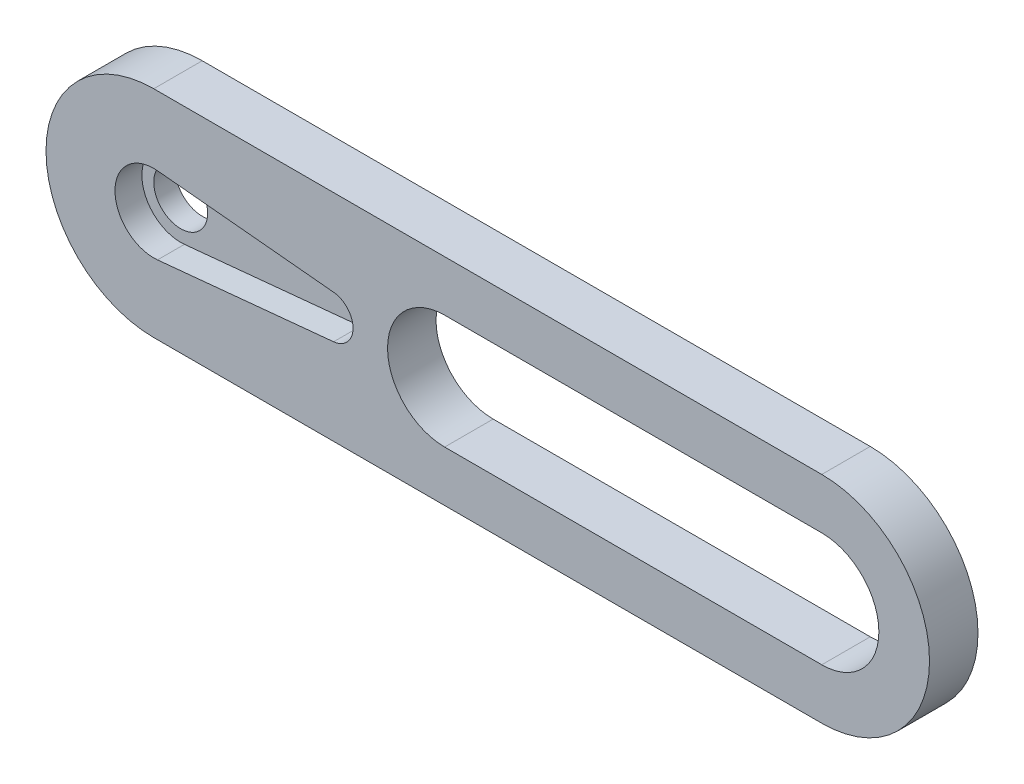
ISO-10303-21;
HEADER;
FILE_DESCRIPTION(('STEP AP214'),'2;1');
FILE_NAME('part.step','',(''),(''),'','','');
FILE_SCHEMA(('AUTOMOTIVE_DESIGN { 1 0 10303 214 1 1 1 1 }'));
ENDSEC;
DATA;
#1=APPLICATION_CONTEXT('core data for automotive mechanical design processes');
#2=APPLICATION_PROTOCOL_DEFINITION('international standard','automotive_design',2000,#1);
#3=PRODUCT_CONTEXT('',#1,'mechanical');
#4=PRODUCT('Part','Part','',(#3));
#5=PRODUCT_RELATED_PRODUCT_CATEGORY('part','',(#4));
#6=PRODUCT_DEFINITION_FORMATION('','',#4);
#7=PRODUCT_DEFINITION_CONTEXT('part definition',#1,'design');
#8=PRODUCT_DEFINITION('design','',#6,#7);
#9=PRODUCT_DEFINITION_SHAPE('','',#8);
#10=(LENGTH_UNIT() NAMED_UNIT(*) SI_UNIT(.MILLI.,.METRE.));
#11=(NAMED_UNIT(*) PLANE_ANGLE_UNIT() SI_UNIT($,.RADIAN.));
#12=(NAMED_UNIT(*) SI_UNIT($,.STERADIAN.) SOLID_ANGLE_UNIT());
#13=UNCERTAINTY_MEASURE_WITH_UNIT(LENGTH_MEASURE(1.E-05),#10,'distance_accuracy_value','');
#14=(GEOMETRIC_REPRESENTATION_CONTEXT(3) GLOBAL_UNCERTAINTY_ASSIGNED_CONTEXT((#13)) GLOBAL_UNIT_ASSIGNED_CONTEXT((#10,
#11,#12)) REPRESENTATION_CONTEXT('',''));
#15=CARTESIAN_POINT('',(0.,0.,0.));
#16=DIRECTION('',(0.,0.,1.));
#17=DIRECTION('',(1.,0.,0.));
#18=AXIS2_PLACEMENT_3D('',#15,#16,#17);
#19=CARTESIAN_POINT('',(0.,0.,2.5));
#20=DIRECTION('',(0.,0.,-1.));
#21=DIRECTION('',(-1.,0.,0.));
#22=AXIS2_PLACEMENT_3D('',#19,#20,#21);
#23=PLANE('',#22);
#24=CARTESIAN_POINT('',(0.,0.,2.5));
#25=DIRECTION('',(0.,0.,1.));
#26=DIRECTION('',(1.,0.,0.));
#27=AXIS2_PLACEMENT_3D('',#24,#25,#26);
#28=CIRCLE('',#27,3.6);
#29=CARTESIAN_POINT('',(0.349090909090909,3.58303440357333,2.5));
#30=VERTEX_POINT('',#29);
#31=CARTESIAN_POINT('',(0.349090909090909,-3.58303440357333,2.5));
#32=VERTEX_POINT('',#31);
#33=EDGE_CURVE('E176',#30,#32,#28,.T.);
#34=ORIENTED_EDGE('',*,*,#33,.F.);
#35=DIRECTION('',(-0.995287334325925,0.096969696969697,0.));
#36=VECTOR('',#35,1.);
#37=CARTESIAN_POINT('',(0.349090909090909,3.58303440357333,2.5));
#38=LINE('',#37,#36);
#39=CARTESIAN_POINT('',(16.6939393939394,1.99057466865185,2.5));
#40=VERTEX_POINT('',#39);
#41=EDGE_CURVE('E184',#40,#30,#38,.T.);
#42=ORIENTED_EDGE('',*,*,#41,.F.);
#43=CARTESIAN_POINT('',(16.5,0.,2.5));
#44=DIRECTION('',(0.,0.,1.));
#45=DIRECTION('',(1.,0.,0.));
#46=AXIS2_PLACEMENT_3D('',#43,#44,#45);
#47=CIRCLE('',#46,2.);
#48=CARTESIAN_POINT('',(16.6939393939394,-1.99057466865185,2.5));
#49=VERTEX_POINT('',#48);
#50=EDGE_CURVE('E181',#49,#40,#47,.T.);
#51=ORIENTED_EDGE('',*,*,#50,.F.);
#52=DIRECTION('',(0.995287334325925,0.0969696969696969,0.));
#53=VECTOR('',#52,1.);
#54=CARTESIAN_POINT('',(16.6939393939394,-1.99057466865185,2.5));
#55=LINE('',#54,#53);
#56=EDGE_CURVE('E178',#32,#49,#55,.T.);
#57=ORIENTED_EDGE('',*,*,#56,.F.);
#58=EDGE_LOOP('',(#34,#42,#51,#57));
#59=FACE_BOUND('',#58,.T.);
#60=CARTESIAN_POINT('',(0.,0.,2.5));
#61=DIRECTION('',(0.,0.,1.));
#62=DIRECTION('',(-1.,0.,0.));
#63=AXIS2_PLACEMENT_3D('',#60,#61,#62);
#64=CIRCLE('',#63,10.);
#65=CARTESIAN_POINT('',(0.,10.,2.5));
#66=VERTEX_POINT('',#65);
#67=CARTESIAN_POINT('',(0.,-10.,2.5));
#68=VERTEX_POINT('',#67);
#69=EDGE_CURVE('E205',#66,#68,#64,.T.);
#70=ORIENTED_EDGE('',*,*,#69,.T.);
#71=DIRECTION('',(1.,0.,0.));
#72=VECTOR('',#71,1.);
#73=CARTESIAN_POINT('',(0.,-10.,2.5));
#74=LINE('',#73,#72);
#75=CARTESIAN_POINT('',(62.,-10.,2.5));
#76=VERTEX_POINT('',#75);
#77=EDGE_CURVE('E208',#68,#76,#74,.T.);
#78=ORIENTED_EDGE('',*,*,#77,.T.);
#79=CARTESIAN_POINT('',(62.,0.,2.5));
#80=DIRECTION('',(0.,0.,1.));
#81=DIRECTION('',(-1.,0.,0.));
#82=AXIS2_PLACEMENT_3D('',#79,#80,#81);
#83=CIRCLE('',#82,10.);
#84=CARTESIAN_POINT('',(62.,10.,2.5));
#85=VERTEX_POINT('',#84);
#86=EDGE_CURVE('E210',#76,#85,#83,.T.);
#87=ORIENTED_EDGE('',*,*,#86,.T.);
#88=DIRECTION('',(-1.,0.,0.));
#89=VECTOR('',#88,1.);
#90=CARTESIAN_POINT('',(0.,10.,2.5));
#91=LINE('',#90,#89);
#92=EDGE_CURVE('E212',#85,#66,#91,.T.);
#93=ORIENTED_EDGE('',*,*,#92,.T.);
#94=EDGE_LOOP('',(#70,#78,#87,#93));
#95=FACE_BOUND('',#94,.T.);
#96=CARTESIAN_POINT('',(27.,0.,2.5));
#97=DIRECTION('',(0.,0.,1.));
#98=DIRECTION('',(1.,0.,0.));
#99=AXIS2_PLACEMENT_3D('',#96,#97,#98);
#100=CIRCLE('',#99,5.3);
#101=CARTESIAN_POINT('',(27.,5.3,2.5));
#102=VERTEX_POINT('',#101);
#103=CARTESIAN_POINT('',(27.,-5.3,2.5));
#104=VERTEX_POINT('',#103);
#105=EDGE_CURVE('E129',#102,#104,#100,.T.);
#106=ORIENTED_EDGE('',*,*,#105,.F.);
#107=DIRECTION('',(-1.,0.,0.));
#108=VECTOR('',#107,1.);
#109=CARTESIAN_POINT('',(27.,5.3,2.5));
#110=LINE('',#109,#108);
#111=CARTESIAN_POINT('',(62.,5.3,2.5));
#112=VERTEX_POINT('',#111);
#113=EDGE_CURVE('E170',#112,#102,#110,.T.);
#114=ORIENTED_EDGE('',*,*,#113,.F.);
#115=CARTESIAN_POINT('',(62.,0.,2.5));
#116=DIRECTION('',(0.,0.,1.));
#117=DIRECTION('',(1.,0.,0.));
#118=AXIS2_PLACEMENT_3D('',#115,#116,#117);
#119=CIRCLE('',#118,5.3);
#120=CARTESIAN_POINT('',(62.,-5.3,2.5));
#121=VERTEX_POINT('',#120);
#122=EDGE_CURVE('E168',#121,#112,#119,.T.);
#123=ORIENTED_EDGE('',*,*,#122,.F.);
#124=DIRECTION('',(1.,0.,0.));
#125=VECTOR('',#124,1.);
#126=CARTESIAN_POINT('',(27.,-5.3,2.5));
#127=LINE('',#126,#125);
#128=EDGE_CURVE('E166',#104,#121,#127,.T.);
#129=ORIENTED_EDGE('',*,*,#128,.F.);
#130=EDGE_LOOP('',(#106,#114,#123,#129));
#131=FACE_BOUND('',#130,.T.);
#132=ADVANCED_FACE('F33',(#59,#95,#131),#23,.F.);
#133=CARTESIAN_POINT('',(0.,0.,2.5));
#134=DIRECTION('',(0.,0.,-1.));
#135=DIRECTION('',(-1.,0.,0.));
#136=AXIS2_PLACEMENT_3D('',#133,#134,#135);
#137=CYLINDRICAL_SURFACE('',#136,10.);
#138=DIRECTION('',(0.,0.,-1.));
#139=VECTOR('',#138,1.);
#140=CARTESIAN_POINT('',(0.,10.,2.5));
#141=LINE('',#140,#139);
#142=CARTESIAN_POINT('',(0.,10.,-2.));
#143=VERTEX_POINT('',#142);
#144=EDGE_CURVE('E214',#66,#143,#141,.T.);
#145=ORIENTED_EDGE('',*,*,#144,.T.);
#146=CARTESIAN_POINT('',(0.,0.,-2.));
#147=DIRECTION('',(0.,0.,-1.));
#148=DIRECTION('',(-1.,0.,0.));
#149=AXIS2_PLACEMENT_3D('',#146,#147,#148);
#150=CIRCLE('',#149,10.);
#151=CARTESIAN_POINT('',(0.,-10.,-2.));
#152=VERTEX_POINT('',#151);
#153=EDGE_CURVE('E151',#152,#143,#150,.T.);
#154=ORIENTED_EDGE('',*,*,#153,.F.);
#155=DIRECTION('',(0.,0.,-1.));
#156=VECTOR('',#155,1.);
#157=CARTESIAN_POINT('',(0.,-10.,2.5));
#158=LINE('',#157,#156);
#159=EDGE_CURVE('E11',#68,#152,#158,.T.);
#160=ORIENTED_EDGE('',*,*,#159,.F.);
#161=ORIENTED_EDGE('',*,*,#69,.F.);
#162=EDGE_LOOP('',(#145,#154,#160,#161));
#163=FACE_BOUND('',#162,.T.);
#164=ADVANCED_FACE('F35',(#163),#137,.T.);
#165=CARTESIAN_POINT('',(0.,-10.,2.5));
#166=DIRECTION('',(0.,1.,0.));
#167=DIRECTION('',(-1.,0.,0.));
#168=AXIS2_PLACEMENT_3D('',#165,#166,#167);
#169=PLANE('',#168);
#170=ORIENTED_EDGE('',*,*,#159,.T.);
#171=DIRECTION('',(-1.,0.,0.));
#172=VECTOR('',#171,1.);
#173=CARTESIAN_POINT('',(0.,-10.,-2.));
#174=LINE('',#173,#172);
#175=CARTESIAN_POINT('',(62.,-10.,-2.));
#176=VERTEX_POINT('',#175);
#177=EDGE_CURVE('E162',#176,#152,#174,.T.);
#178=ORIENTED_EDGE('',*,*,#177,.F.);
#179=DIRECTION('',(0.,0.,-1.));
#180=VECTOR('',#179,1.);
#181=CARTESIAN_POINT('',(62.,-10.,2.5));
#182=LINE('',#181,#180);
#183=EDGE_CURVE('E41',#76,#176,#182,.T.);
#184=ORIENTED_EDGE('',*,*,#183,.F.);
#185=ORIENTED_EDGE('',*,*,#77,.F.);
#186=EDGE_LOOP('',(#170,#178,#184,#185));
#187=FACE_BOUND('',#186,.T.);
#188=ADVANCED_FACE('F228',(#187),#169,.F.);
#189=CARTESIAN_POINT('',(62.,0.,2.5));
#190=DIRECTION('',(0.,0.,-1.));
#191=DIRECTION('',(-1.,0.,0.));
#192=AXIS2_PLACEMENT_3D('',#189,#190,#191);
#193=CYLINDRICAL_SURFACE('',#192,10.);
#194=ORIENTED_EDGE('',*,*,#183,.T.);
#195=CARTESIAN_POINT('',(62.,0.,-2.));
#196=DIRECTION('',(0.,0.,-1.));
#197=DIRECTION('',(-1.,0.,0.));
#198=AXIS2_PLACEMENT_3D('',#195,#196,#197);
#199=CIRCLE('',#198,10.);
#200=CARTESIAN_POINT('',(62.,10.,-2.));
#201=VERTEX_POINT('',#200);
#202=EDGE_CURVE('E159',#201,#176,#199,.T.);
#203=ORIENTED_EDGE('',*,*,#202,.F.);
#204=DIRECTION('',(0.,0.,-1.));
#205=VECTOR('',#204,1.);
#206=CARTESIAN_POINT('',(62.,10.,2.5));
#207=LINE('',#206,#205);
#208=EDGE_CURVE('E216',#85,#201,#207,.T.);
#209=ORIENTED_EDGE('',*,*,#208,.F.);
#210=ORIENTED_EDGE('',*,*,#86,.F.);
#211=EDGE_LOOP('',(#194,#203,#209,#210));
#212=FACE_BOUND('',#211,.T.);
#213=ADVANCED_FACE('F221',(#212),#193,.T.);
#214=CARTESIAN_POINT('',(0.,10.,2.5));
#215=DIRECTION('',(0.,-1.,0.));
#216=DIRECTION('',(1.,0.,0.));
#217=AXIS2_PLACEMENT_3D('',#214,#215,#216);
#218=PLANE('',#217);
#219=ORIENTED_EDGE('',*,*,#208,.T.);
#220=DIRECTION('',(1.,0.,0.));
#221=VECTOR('',#220,1.);
#222=CARTESIAN_POINT('',(0.,10.,-2.));
#223=LINE('',#222,#221);
#224=EDGE_CURVE('E156',#143,#201,#223,.T.);
#225=ORIENTED_EDGE('',*,*,#224,.F.);
#226=ORIENTED_EDGE('',*,*,#144,.F.);
#227=ORIENTED_EDGE('',*,*,#92,.F.);
#228=EDGE_LOOP('',(#219,#225,#226,#227));
#229=FACE_BOUND('',#228,.T.);
#230=ADVANCED_FACE('F235',(#229),#218,.F.);
#231=CARTESIAN_POINT('',(0.,0.,2.5));
#232=DIRECTION('',(0.,0.,-1.));
#233=DIRECTION('',(-1.,0.,0.));
#234=AXIS2_PLACEMENT_3D('',#231,#232,#233);
#235=CYLINDRICAL_SURFACE('',#234,3.6);
#236=CARTESIAN_POINT('',(0.,0.,0.));
#237=DIRECTION('',(0.,0.,1.));
#238=DIRECTION('',(1.,0.,0.));
#239=AXIS2_PLACEMENT_3D('',#236,#237,#238);
#240=CIRCLE('',#239,3.6);
#241=CARTESIAN_POINT('',(0.349090909090909,3.58303440357333,0.));
#242=VERTEX_POINT('',#241);
#243=CARTESIAN_POINT('',(0.349090909090909,-3.58303440357333,0.));
#244=VERTEX_POINT('',#243);
#245=EDGE_CURVE('E131',#242,#244,#240,.T.);
#246=ORIENTED_EDGE('',*,*,#245,.F.);
#247=DIRECTION('',(0.,0.,-1.));
#248=VECTOR('',#247,1.);
#249=CARTESIAN_POINT('',(0.349090909090909,3.58303440357333,2.5));
#250=LINE('',#249,#248);
#251=EDGE_CURVE('E186',#30,#242,#250,.T.);
#252=ORIENTED_EDGE('',*,*,#251,.F.);
#253=ORIENTED_EDGE('',*,*,#33,.T.);
#254=DIRECTION('',(0.,0.,-1.));
#255=VECTOR('',#254,1.);
#256=CARTESIAN_POINT('',(0.349090909090909,-3.58303440357333,2.5));
#257=LINE('',#256,#255);
#258=EDGE_CURVE('E202',#32,#244,#257,.T.);
#259=ORIENTED_EDGE('',*,*,#258,.T.);
#260=EDGE_LOOP('',(#246,#252,#253,#259));
#261=FACE_BOUND('',#260,.T.);
#262=ADVANCED_FACE('F273',(#261),#235,.F.);
#263=CARTESIAN_POINT('',(16.6939393939394,-1.99057466865185,2.5));
#264=DIRECTION('',(-0.0969696969696969,0.995287334325925,0.));
#265=DIRECTION('',(-0.995287334325925,-0.0969696969696969,0.));
#266=AXIS2_PLACEMENT_3D('',#263,#264,#265);
#267=PLANE('',#266);
#268=DIRECTION('',(0.995287334325925,0.0969696969696969,0.));
#269=VECTOR('',#268,1.);
#270=CARTESIAN_POINT('',(16.6939393939394,-1.99057466865185,0.));
#271=LINE('',#270,#269);
#272=CARTESIAN_POINT('',(16.6939393939394,-1.99057466865185,0.));
#273=VERTEX_POINT('',#272);
#274=EDGE_CURVE('E189',#244,#273,#271,.T.);
#275=ORIENTED_EDGE('',*,*,#274,.F.);
#276=ORIENTED_EDGE('',*,*,#258,.F.);
#277=ORIENTED_EDGE('',*,*,#56,.T.);
#278=DIRECTION('',(0.,0.,-1.));
#279=VECTOR('',#278,1.);
#280=CARTESIAN_POINT('',(16.6939393939394,-1.99057466865185,2.5));
#281=LINE('',#280,#279);
#282=EDGE_CURVE('E200',#49,#273,#281,.T.);
#283=ORIENTED_EDGE('',*,*,#282,.T.);
#284=EDGE_LOOP('',(#275,#276,#277,#283));
#285=FACE_BOUND('',#284,.T.);
#286=ADVANCED_FACE('F269',(#285),#267,.T.);
#287=CARTESIAN_POINT('',(16.5,0.,2.5));
#288=DIRECTION('',(0.,0.,-1.));
#289=DIRECTION('',(-1.,0.,0.));
#290=AXIS2_PLACEMENT_3D('',#287,#288,#289);
#291=CYLINDRICAL_SURFACE('',#290,2.);
#292=CARTESIAN_POINT('',(16.5,0.,0.));
#293=DIRECTION('',(0.,0.,1.));
#294=DIRECTION('',(1.,0.,0.));
#295=AXIS2_PLACEMENT_3D('',#292,#293,#294);
#296=CIRCLE('',#295,2.);
#297=CARTESIAN_POINT('',(16.6939393939394,1.99057466865185,0.));
#298=VERTEX_POINT('',#297);
#299=EDGE_CURVE('E192',#273,#298,#296,.T.);
#300=ORIENTED_EDGE('',*,*,#299,.F.);
#301=ORIENTED_EDGE('',*,*,#282,.F.);
#302=ORIENTED_EDGE('',*,*,#50,.T.);
#303=DIRECTION('',(0.,0.,-1.));
#304=VECTOR('',#303,1.);
#305=CARTESIAN_POINT('',(16.6939393939394,1.99057466865185,2.5));
#306=LINE('',#305,#304);
#307=EDGE_CURVE('E198',#40,#298,#306,.T.);
#308=ORIENTED_EDGE('',*,*,#307,.T.);
#309=EDGE_LOOP('',(#300,#301,#302,#308));
#310=FACE_BOUND('',#309,.T.);
#311=ADVANCED_FACE('F265',(#310),#291,.F.);
#312=CARTESIAN_POINT('',(0.349090909090909,3.58303440357333,2.5));
#313=DIRECTION('',(-0.096969696969697,-0.995287334325925,0.));
#314=DIRECTION('',(0.995287334325925,-0.096969696969697,0.));
#315=AXIS2_PLACEMENT_3D('',#312,#313,#314);
#316=PLANE('',#315);
#317=DIRECTION('',(-0.995287334325925,0.096969696969697,0.));
#318=VECTOR('',#317,1.);
#319=CARTESIAN_POINT('',(0.349090909090909,3.58303440357333,0.));
#320=LINE('',#319,#318);
#321=EDGE_CURVE('E179',#298,#242,#320,.T.);
#322=ORIENTED_EDGE('',*,*,#321,.F.);
#323=ORIENTED_EDGE('',*,*,#307,.F.);
#324=ORIENTED_EDGE('',*,*,#41,.T.);
#325=ORIENTED_EDGE('',*,*,#251,.T.);
#326=EDGE_LOOP('',(#322,#323,#324,#325));
#327=FACE_BOUND('',#326,.T.);
#328=ADVANCED_FACE('F262',(#327),#316,.T.);
#329=CARTESIAN_POINT('',(27.,0.,2.5));
#330=DIRECTION('',(0.,0.,-1.));
#331=DIRECTION('',(-1.,0.,0.));
#332=AXIS2_PLACEMENT_3D('',#329,#330,#331);
#333=CYLINDRICAL_SURFACE('',#332,5.3);
#334=DIRECTION('',(0.,0.,-1.));
#335=VECTOR('',#334,1.);
#336=CARTESIAN_POINT('',(27.,-5.3,2.5));
#337=LINE('',#336,#335);
#338=CARTESIAN_POINT('',(27.,-5.3,-2.));
#339=VERTEX_POINT('',#338);
#340=EDGE_CURVE('E122',#104,#339,#337,.T.);
#341=ORIENTED_EDGE('',*,*,#340,.T.);
#342=CARTESIAN_POINT('',(27.,0.,-2.));
#343=DIRECTION('',(0.,0.,1.));
#344=DIRECTION('',(1.,0.,0.));
#345=AXIS2_PLACEMENT_3D('',#342,#343,#344);
#346=CIRCLE('',#345,5.3);
#347=CARTESIAN_POINT('',(27.,5.3,-2.));
#348=VERTEX_POINT('',#347);
#349=EDGE_CURVE('E126',#348,#339,#346,.T.);
#350=ORIENTED_EDGE('',*,*,#349,.F.);
#351=DIRECTION('',(0.,0.,-1.));
#352=VECTOR('',#351,1.);
#353=CARTESIAN_POINT('',(27.,5.3,2.5));
#354=LINE('',#353,#352);
#355=EDGE_CURVE('E172',#102,#348,#354,.T.);
#356=ORIENTED_EDGE('',*,*,#355,.F.);
#357=ORIENTED_EDGE('',*,*,#105,.T.);
#358=EDGE_LOOP('',(#341,#350,#356,#357));
#359=FACE_BOUND('',#358,.T.);
#360=ADVANCED_FACE('F123',(#359),#333,.F.);
#361=CARTESIAN_POINT('',(27.,-5.3,2.5));
#362=DIRECTION('',(0.,1.,0.));
#363=DIRECTION('',(0.,0.,1.));
#364=AXIS2_PLACEMENT_3D('',#361,#362,#363);
#365=PLANE('',#364);
#366=DIRECTION('',(0.,0.,-1.));
#367=VECTOR('',#366,1.);
#368=CARTESIAN_POINT('',(62.,-5.3,2.5));
#369=LINE('',#368,#367);
#370=CARTESIAN_POINT('',(62.,-5.3,-2.));
#371=VERTEX_POINT('',#370);
#372=EDGE_CURVE('E48',#121,#371,#369,.T.);
#373=ORIENTED_EDGE('',*,*,#372,.T.);
#374=DIRECTION('',(1.,0.,0.));
#375=VECTOR('',#374,1.);
#376=CARTESIAN_POINT('',(27.,-5.3,-2.));
#377=LINE('',#376,#375);
#378=EDGE_CURVE('E134',#339,#371,#377,.T.);
#379=ORIENTED_EDGE('',*,*,#378,.F.);
#380=ORIENTED_EDGE('',*,*,#340,.F.);
#381=ORIENTED_EDGE('',*,*,#128,.T.);
#382=EDGE_LOOP('',(#373,#379,#380,#381));
#383=FACE_BOUND('',#382,.T.);
#384=ADVANCED_FACE('F135',(#383),#365,.T.);
#385=CARTESIAN_POINT('',(62.,0.,2.5));
#386=DIRECTION('',(0.,0.,-1.));
#387=DIRECTION('',(-1.,0.,0.));
#388=AXIS2_PLACEMENT_3D('',#385,#386,#387);
#389=CYLINDRICAL_SURFACE('',#388,5.3);
#390=DIRECTION('',(0.,0.,-1.));
#391=VECTOR('',#390,1.);
#392=CARTESIAN_POINT('',(62.,5.3,2.5));
#393=LINE('',#392,#391);
#394=CARTESIAN_POINT('',(62.,5.3,-2.));
#395=VERTEX_POINT('',#394);
#396=EDGE_CURVE('E56',#112,#395,#393,.T.);
#397=ORIENTED_EDGE('',*,*,#396,.T.);
#398=CARTESIAN_POINT('',(62.,0.,-2.));
#399=DIRECTION('',(0.,0.,1.));
#400=DIRECTION('',(1.,0.,0.));
#401=AXIS2_PLACEMENT_3D('',#398,#399,#400);
#402=CIRCLE('',#401,5.3);
#403=EDGE_CURVE('E138',#371,#395,#402,.T.);
#404=ORIENTED_EDGE('',*,*,#403,.F.);
#405=ORIENTED_EDGE('',*,*,#372,.F.);
#406=ORIENTED_EDGE('',*,*,#122,.T.);
#407=EDGE_LOOP('',(#397,#404,#405,#406));
#408=FACE_BOUND('',#407,.T.);
#409=ADVANCED_FACE('F244',(#408),#389,.F.);
#410=CARTESIAN_POINT('',(27.,5.3,2.5));
#411=DIRECTION('',(0.,-1.,0.));
#412=DIRECTION('',(0.,0.,-1.));
#413=AXIS2_PLACEMENT_3D('',#410,#411,#412);
#414=PLANE('',#413);
#415=ORIENTED_EDGE('',*,*,#355,.T.);
#416=DIRECTION('',(-1.,0.,0.));
#417=VECTOR('',#416,1.);
#418=CARTESIAN_POINT('',(27.,5.3,-2.));
#419=LINE('',#418,#417);
#420=EDGE_CURVE('E142',#395,#348,#419,.T.);
#421=ORIENTED_EDGE('',*,*,#420,.F.);
#422=ORIENTED_EDGE('',*,*,#396,.F.);
#423=ORIENTED_EDGE('',*,*,#113,.T.);
#424=EDGE_LOOP('',(#415,#421,#422,#423));
#425=FACE_BOUND('',#424,.T.);
#426=ADVANCED_FACE('F245',(#425),#414,.T.);
#427=CARTESIAN_POINT('',(0.,0.,0.));
#428=DIRECTION('',(0.,0.,-1.));
#429=DIRECTION('',(-1.,0.,0.));
#430=AXIS2_PLACEMENT_3D('',#427,#428,#429);
#431=PLANE('',#430);
#432=ORIENTED_EDGE('',*,*,#245,.T.);
#433=ORIENTED_EDGE('',*,*,#274,.T.);
#434=ORIENTED_EDGE('',*,*,#299,.T.);
#435=ORIENTED_EDGE('',*,*,#321,.T.);
#436=EDGE_LOOP('',(#432,#433,#434,#435));
#437=FACE_BOUND('',#436,.T.);
#438=CARTESIAN_POINT('',(0.,0.,0.));
#439=DIRECTION('',(0.,0.,-1.));
#440=DIRECTION('',(-1.,0.,0.));
#441=AXIS2_PLACEMENT_3D('',#438,#439,#440);
#442=CIRCLE('',#441,2.5);
#443=CARTESIAN_POINT('',(-2.5,0.,0.));
#444=VERTEX_POINT('',#443);
#445=EDGE_CURVE('E147',#444,#444,#442,.T.);
#446=ORIENTED_EDGE('',*,*,#445,.T.);
#447=EDGE_LOOP('',(#446));
#448=FACE_BOUND('',#447,.T.);
#449=ADVANCED_FACE('F247',(#437,#448),#431,.F.);
#450=CARTESIAN_POINT('',(0.,0.,-2.));
#451=DIRECTION('',(0.,0.,-1.));
#452=DIRECTION('',(-1.,0.,0.));
#453=AXIS2_PLACEMENT_3D('',#450,#451,#452);
#454=PLANE('',#453);
#455=ORIENTED_EDGE('',*,*,#349,.T.);
#456=ORIENTED_EDGE('',*,*,#378,.T.);
#457=ORIENTED_EDGE('',*,*,#403,.T.);
#458=ORIENTED_EDGE('',*,*,#420,.T.);
#459=EDGE_LOOP('',(#455,#456,#457,#458));
#460=FACE_BOUND('',#459,.T.);
#461=ORIENTED_EDGE('',*,*,#153,.T.);
#462=ORIENTED_EDGE('',*,*,#224,.T.);
#463=ORIENTED_EDGE('',*,*,#202,.T.);
#464=ORIENTED_EDGE('',*,*,#177,.T.);
#465=EDGE_LOOP('',(#461,#462,#463,#464));
#466=FACE_BOUND('',#465,.T.);
#467=CARTESIAN_POINT('',(0.,0.,-2.));
#468=DIRECTION('',(0.,0.,-1.));
#469=DIRECTION('',(-1.,0.,0.));
#470=AXIS2_PLACEMENT_3D('',#467,#468,#469);
#471=CIRCLE('',#470,2.5);
#472=CARTESIAN_POINT('',(-2.5,0.,-2.));
#473=VERTEX_POINT('',#472);
#474=EDGE_CURVE('E148',#473,#473,#471,.T.);
#475=ORIENTED_EDGE('',*,*,#474,.F.);
#476=EDGE_LOOP('',(#475));
#477=FACE_BOUND('',#476,.T.);
#478=ADVANCED_FACE('F140',(#460,#466,#477),#454,.T.);
#479=CARTESIAN_POINT('',(0.,0.,-2.));
#480=DIRECTION('',(0.,0.,1.));
#481=DIRECTION('',(1.,0.,0.));
#482=AXIS2_PLACEMENT_3D('',#479,#480,#481);
#483=CYLINDRICAL_SURFACE('',#482,2.5);
#484=ORIENTED_EDGE('',*,*,#474,.T.);
#485=EDGE_LOOP('',(#484));
#486=FACE_BOUND('',#485,.T.);
#487=ORIENTED_EDGE('',*,*,#445,.F.);
#488=EDGE_LOOP('',(#487));
#489=FACE_BOUND('',#488,.T.);
#490=ADVANCED_FACE('F379',(#486,#489),#483,.F.);
#491=CLOSED_SHELL('',(#132,#164,#188,#213,#230,#262,#286,#311,#328,#360,#384,#409,#426,#449,
#478,#490));
#492=MANIFOLD_SOLID_BREP('B2',#491);
#493=ADVANCED_BREP_SHAPE_REPRESENTATION('',(#18,#492),#14);
#494=SHAPE_DEFINITION_REPRESENTATION(#9,#493);
ENDSEC;
END-ISO-10303-21;
